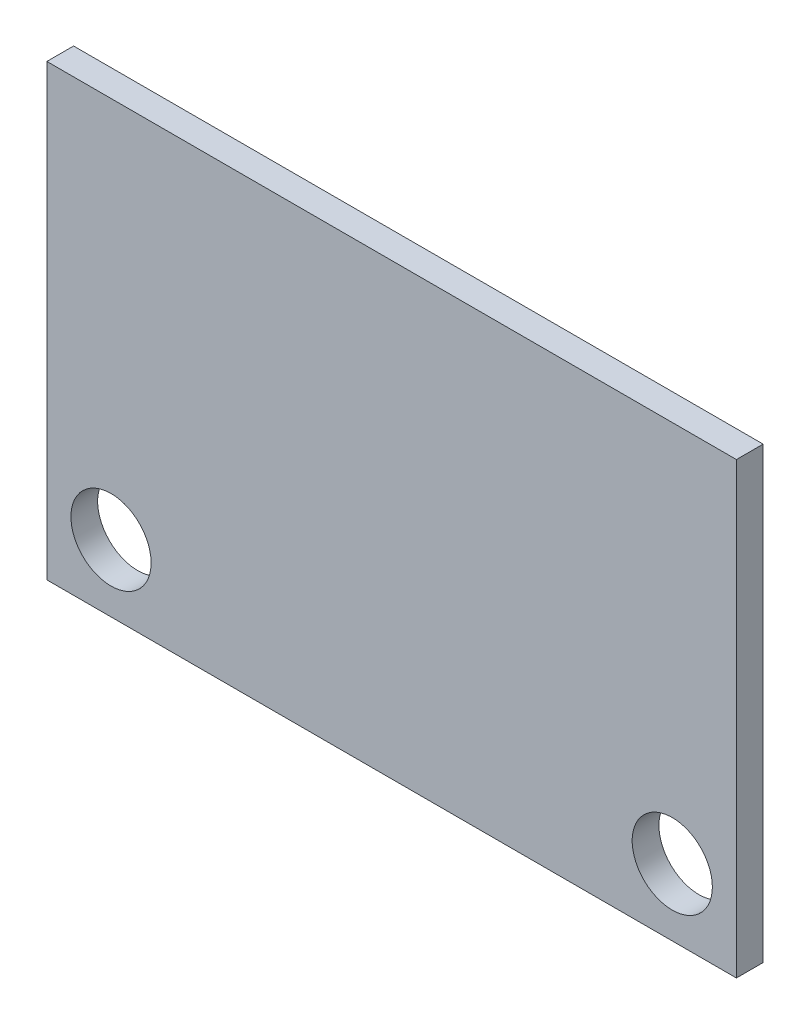
ISO-10303-21;
HEADER;
FILE_DESCRIPTION(('STEP AP214'),'2;1');
FILE_NAME('part.step','',(''),(''),'','','');
FILE_SCHEMA(('AUTOMOTIVE_DESIGN { 1 0 10303 214 1 1 1 1 }'));
ENDSEC;
DATA;
#1=APPLICATION_CONTEXT('core data for automotive mechanical design processes');
#2=APPLICATION_PROTOCOL_DEFINITION('international standard','automotive_design',2000,#1);
#3=PRODUCT_CONTEXT('',#1,'mechanical');
#4=PRODUCT('Part','Part','',(#3));
#5=PRODUCT_RELATED_PRODUCT_CATEGORY('part','',(#4));
#6=PRODUCT_DEFINITION_FORMATION('','',#4);
#7=PRODUCT_DEFINITION_CONTEXT('part definition',#1,'design');
#8=PRODUCT_DEFINITION('design','',#6,#7);
#9=PRODUCT_DEFINITION_SHAPE('','',#8);
#10=(LENGTH_UNIT() NAMED_UNIT(*) SI_UNIT(.MILLI.,.METRE.));
#11=(NAMED_UNIT(*) PLANE_ANGLE_UNIT() SI_UNIT($,.RADIAN.));
#12=(NAMED_UNIT(*) SI_UNIT($,.STERADIAN.) SOLID_ANGLE_UNIT());
#13=UNCERTAINTY_MEASURE_WITH_UNIT(LENGTH_MEASURE(1.E-05),#10,'distance_accuracy_value','');
#14=(GEOMETRIC_REPRESENTATION_CONTEXT(3) GLOBAL_UNCERTAINTY_ASSIGNED_CONTEXT((#13)) GLOBAL_UNIT_ASSIGNED_CONTEXT((#10,
#11,#12)) REPRESENTATION_CONTEXT('',''));
#15=CARTESIAN_POINT('',(0.,0.,0.));
#16=DIRECTION('',(0.,0.,1.));
#17=DIRECTION('',(1.,0.,0.));
#18=AXIS2_PLACEMENT_3D('',#15,#16,#17);
#19=CARTESIAN_POINT('',(-12.9,8.4,1.));
#20=DIRECTION('',(0.,0.,1.));
#21=DIRECTION('',(1.,0.,0.));
#22=AXIS2_PLACEMENT_3D('',#19,#20,#21);
#23=PLANE('',#22);
#24=CARTESIAN_POINT('',(-10.5,-5.9,1.));
#25=DIRECTION('',(0.,0.,1.));
#26=DIRECTION('',(1.,0.,0.));
#27=AXIS2_PLACEMENT_3D('',#24,#25,#26);
#28=CIRCLE('',#27,1.5);
#29=CARTESIAN_POINT('',(-8.99999999999999,-5.9,1.));
#30=VERTEX_POINT('',#29);
#31=EDGE_CURVE('E98',#30,#30,#28,.T.);
#32=ORIENTED_EDGE('',*,*,#31,.F.);
#33=EDGE_LOOP('',(#32));
#34=FACE_BOUND('',#33,.T.);
#35=DIRECTION('',(0.,-1.,0.));
#36=VECTOR('',#35,1.);
#37=CARTESIAN_POINT('',(-12.9,-8.4,1.));
#38=LINE('',#37,#36);
#39=CARTESIAN_POINT('',(-12.9,8.4,1.));
#40=VERTEX_POINT('',#39);
#41=CARTESIAN_POINT('',(-12.9,-8.4,1.));
#42=VERTEX_POINT('',#41);
#43=EDGE_CURVE('E83',#40,#42,#38,.T.);
#44=ORIENTED_EDGE('',*,*,#43,.T.);
#45=DIRECTION('',(1.,0.,0.));
#46=VECTOR('',#45,1.);
#47=CARTESIAN_POINT('',(12.9,-8.4,1.));
#48=LINE('',#47,#46);
#49=CARTESIAN_POINT('',(12.9,-8.4,1.));
#50=VERTEX_POINT('',#49);
#51=EDGE_CURVE('E78',#42,#50,#48,.T.);
#52=ORIENTED_EDGE('',*,*,#51,.T.);
#53=DIRECTION('',(0.,1.,0.));
#54=VECTOR('',#53,1.);
#55=CARTESIAN_POINT('',(12.9,-8.4,1.));
#56=LINE('',#55,#54);
#57=CARTESIAN_POINT('',(12.9,8.4,1.));
#58=VERTEX_POINT('',#57);
#59=EDGE_CURVE('E81',#50,#58,#56,.T.);
#60=ORIENTED_EDGE('',*,*,#59,.T.);
#61=DIRECTION('',(-1.,0.,0.));
#62=VECTOR('',#61,1.);
#63=CARTESIAN_POINT('',(12.9,8.4,1.));
#64=LINE('',#63,#62);
#65=EDGE_CURVE('E48',#58,#40,#64,.T.);
#66=ORIENTED_EDGE('',*,*,#65,.T.);
#67=EDGE_LOOP('',(#44,#52,#60,#66));
#68=FACE_BOUND('',#67,.T.);
#69=CARTESIAN_POINT('',(10.5,-5.9,1.));
#70=DIRECTION('',(0.,0.,1.));
#71=DIRECTION('',(1.,0.,0.));
#72=AXIS2_PLACEMENT_3D('',#69,#70,#71);
#73=CIRCLE('',#72,1.5);
#74=CARTESIAN_POINT('',(12.,-5.9,1.));
#75=VERTEX_POINT('',#74);
#76=EDGE_CURVE('E113',#75,#75,#73,.T.);
#77=ORIENTED_EDGE('',*,*,#76,.F.);
#78=EDGE_LOOP('',(#77));
#79=FACE_BOUND('',#78,.T.);
#80=ADVANCED_FACE('F31',(#34,#68,#79),#23,.T.);
#81=CARTESIAN_POINT('',(-12.9,8.4,0.));
#82=DIRECTION('',(0.,0.,1.));
#83=DIRECTION('',(1.,0.,0.));
#84=AXIS2_PLACEMENT_3D('',#81,#82,#83);
#85=PLANE('',#84);
#86=CARTESIAN_POINT('',(-10.5,-5.9,0.));
#87=DIRECTION('',(0.,0.,1.));
#88=DIRECTION('',(1.,0.,0.));
#89=AXIS2_PLACEMENT_3D('',#86,#87,#88);
#90=CIRCLE('',#89,1.5);
#91=CARTESIAN_POINT('',(-8.99999999999999,-5.9,0.));
#92=VERTEX_POINT('',#91);
#93=EDGE_CURVE('E110',#92,#92,#90,.T.);
#94=ORIENTED_EDGE('',*,*,#93,.T.);
#95=EDGE_LOOP('',(#94));
#96=FACE_BOUND('',#95,.T.);
#97=DIRECTION('',(0.,-1.,0.));
#98=VECTOR('',#97,1.);
#99=CARTESIAN_POINT('',(-12.9,-8.4,0.));
#100=LINE('',#99,#98);
#101=CARTESIAN_POINT('',(-12.9,8.4,0.));
#102=VERTEX_POINT('',#101);
#103=CARTESIAN_POINT('',(-12.9,-8.4,0.));
#104=VERTEX_POINT('',#103);
#105=EDGE_CURVE('E95',#102,#104,#100,.T.);
#106=ORIENTED_EDGE('',*,*,#105,.F.);
#107=DIRECTION('',(-1.,0.,0.));
#108=VECTOR('',#107,1.);
#109=CARTESIAN_POINT('',(12.9,8.4,0.));
#110=LINE('',#109,#108);
#111=CARTESIAN_POINT('',(12.9,8.4,0.));
#112=VERTEX_POINT('',#111);
#113=EDGE_CURVE('E71',#112,#102,#110,.T.);
#114=ORIENTED_EDGE('',*,*,#113,.F.);
#115=DIRECTION('',(0.,1.,0.));
#116=VECTOR('',#115,1.);
#117=CARTESIAN_POINT('',(12.9,-8.4,0.));
#118=LINE('',#117,#116);
#119=CARTESIAN_POINT('',(12.9,-8.4,0.));
#120=VERTEX_POINT('',#119);
#121=EDGE_CURVE('E65',#120,#112,#118,.T.);
#122=ORIENTED_EDGE('',*,*,#121,.F.);
#123=DIRECTION('',(1.,0.,0.));
#124=VECTOR('',#123,1.);
#125=CARTESIAN_POINT('',(12.9,-8.4,0.));
#126=LINE('',#125,#124);
#127=EDGE_CURVE('E87',#104,#120,#126,.T.);
#128=ORIENTED_EDGE('',*,*,#127,.F.);
#129=EDGE_LOOP('',(#106,#114,#122,#128));
#130=FACE_BOUND('',#129,.T.);
#131=CARTESIAN_POINT('',(10.5,-5.9,0.));
#132=DIRECTION('',(0.,0.,1.));
#133=DIRECTION('',(1.,0.,0.));
#134=AXIS2_PLACEMENT_3D('',#131,#132,#133);
#135=CIRCLE('',#134,1.5);
#136=CARTESIAN_POINT('',(12.,-5.9,0.));
#137=VERTEX_POINT('',#136);
#138=EDGE_CURVE('E116',#137,#137,#135,.T.);
#139=ORIENTED_EDGE('',*,*,#138,.T.);
#140=EDGE_LOOP('',(#139));
#141=FACE_BOUND('',#140,.T.);
#142=ADVANCED_FACE('F106',(#96,#130,#141),#85,.F.);
#143=CARTESIAN_POINT('',(-12.9,-8.4,1.));
#144=DIRECTION('',(1.,0.,0.));
#145=DIRECTION('',(0.,0.,-1.));
#146=AXIS2_PLACEMENT_3D('',#143,#144,#145);
#147=PLANE('',#146);
#148=ORIENTED_EDGE('',*,*,#105,.T.);
#149=DIRECTION('',(0.,0.,-1.));
#150=VECTOR('',#149,1.);
#151=CARTESIAN_POINT('',(-12.9,-8.4,1.));
#152=LINE('',#151,#150);
#153=EDGE_CURVE('E11',#42,#104,#152,.T.);
#154=ORIENTED_EDGE('',*,*,#153,.F.);
#155=ORIENTED_EDGE('',*,*,#43,.F.);
#156=DIRECTION('',(0.,0.,-1.));
#157=VECTOR('',#156,1.);
#158=CARTESIAN_POINT('',(-12.9,8.4,1.));
#159=LINE('',#158,#157);
#160=EDGE_CURVE('E91',#40,#102,#159,.T.);
#161=ORIENTED_EDGE('',*,*,#160,.T.);
#162=EDGE_LOOP('',(#148,#154,#155,#161));
#163=FACE_BOUND('',#162,.T.);
#164=ADVANCED_FACE('F33',(#163),#147,.F.);
#165=CARTESIAN_POINT('',(12.9,-8.4,1.));
#166=DIRECTION('',(0.,1.,0.));
#167=DIRECTION('',(-1.,0.,0.));
#168=AXIS2_PLACEMENT_3D('',#165,#166,#167);
#169=PLANE('',#168);
#170=ORIENTED_EDGE('',*,*,#127,.T.);
#171=DIRECTION('',(0.,0.,-1.));
#172=VECTOR('',#171,1.);
#173=CARTESIAN_POINT('',(12.9,-8.4,1.));
#174=LINE('',#173,#172);
#175=EDGE_CURVE('E40',#50,#120,#174,.T.);
#176=ORIENTED_EDGE('',*,*,#175,.F.);
#177=ORIENTED_EDGE('',*,*,#51,.F.);
#178=ORIENTED_EDGE('',*,*,#153,.T.);
#179=EDGE_LOOP('',(#170,#176,#177,#178));
#180=FACE_BOUND('',#179,.T.);
#181=ADVANCED_FACE('F86',(#180),#169,.F.);
#182=CARTESIAN_POINT('',(12.9,-8.4,1.));
#183=DIRECTION('',(-1.,0.,0.));
#184=DIRECTION('',(0.,0.,1.));
#185=AXIS2_PLACEMENT_3D('',#182,#183,#184);
#186=PLANE('',#185);
#187=ORIENTED_EDGE('',*,*,#121,.T.);
#188=DIRECTION('',(0.,0.,-1.));
#189=VECTOR('',#188,1.);
#190=CARTESIAN_POINT('',(12.9,8.4,1.));
#191=LINE('',#190,#189);
#192=EDGE_CURVE('E88',#58,#112,#191,.T.);
#193=ORIENTED_EDGE('',*,*,#192,.F.);
#194=ORIENTED_EDGE('',*,*,#59,.F.);
#195=ORIENTED_EDGE('',*,*,#175,.T.);
#196=EDGE_LOOP('',(#187,#193,#194,#195));
#197=FACE_BOUND('',#196,.T.);
#198=ADVANCED_FACE('F89',(#197),#186,.F.);
#199=CARTESIAN_POINT('',(12.9,8.4,1.));
#200=DIRECTION('',(0.,-1.,0.));
#201=DIRECTION('',(0.,0.,-1.));
#202=AXIS2_PLACEMENT_3D('',#199,#200,#201);
#203=PLANE('',#202);
#204=ORIENTED_EDGE('',*,*,#113,.T.);
#205=ORIENTED_EDGE('',*,*,#160,.F.);
#206=ORIENTED_EDGE('',*,*,#65,.F.);
#207=ORIENTED_EDGE('',*,*,#192,.T.);
#208=EDGE_LOOP('',(#204,#205,#206,#207));
#209=FACE_BOUND('',#208,.T.);
#210=ADVANCED_FACE('F103',(#209),#203,.F.);
#211=CARTESIAN_POINT('',(-10.5,-5.9,1.));
#212=DIRECTION('',(0.,0.,-1.));
#213=DIRECTION('',(-1.,0.,0.));
#214=AXIS2_PLACEMENT_3D('',#211,#212,#213);
#215=CYLINDRICAL_SURFACE('',#214,1.5);
#216=ORIENTED_EDGE('',*,*,#31,.T.);
#217=EDGE_LOOP('',(#216));
#218=FACE_BOUND('',#217,.T.);
#219=ORIENTED_EDGE('',*,*,#93,.F.);
#220=EDGE_LOOP('',(#219));
#221=FACE_BOUND('',#220,.T.);
#222=ADVANCED_FACE('F134',(#218,#221),#215,.F.);
#223=CARTESIAN_POINT('',(10.5,-5.9,1.));
#224=DIRECTION('',(0.,0.,-1.));
#225=DIRECTION('',(-1.,0.,0.));
#226=AXIS2_PLACEMENT_3D('',#223,#224,#225);
#227=CYLINDRICAL_SURFACE('',#226,1.5);
#228=ORIENTED_EDGE('',*,*,#76,.T.);
#229=EDGE_LOOP('',(#228));
#230=FACE_BOUND('',#229,.T.);
#231=ORIENTED_EDGE('',*,*,#138,.F.);
#232=EDGE_LOOP('',(#231));
#233=FACE_BOUND('',#232,.T.);
#234=ADVANCED_FACE('F122',(#230,#233),#227,.F.);
#235=CLOSED_SHELL('',(#80,#142,#164,#181,#198,#210,#222,#234));
#236=MANIFOLD_SOLID_BREP('B2',#235);
#237=ADVANCED_BREP_SHAPE_REPRESENTATION('',(#18,#236),#14);
#238=SHAPE_DEFINITION_REPRESENTATION(#9,#237);
ENDSEC;
END-ISO-10303-21;
